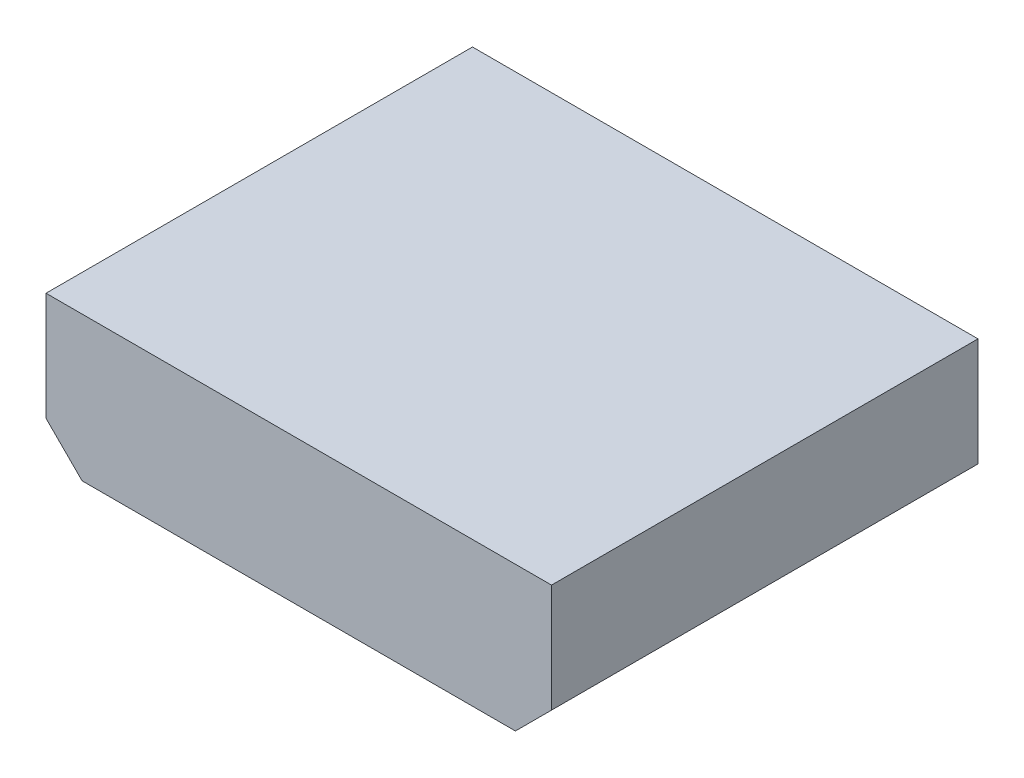
ISO-10303-21;
HEADER;
FILE_DESCRIPTION(('STEP AP214'),'2;1');
FILE_NAME('part.step','',(''),(''),'','','');
FILE_SCHEMA(('AUTOMOTIVE_DESIGN { 1 0 10303 214 1 1 1 1 }'));
ENDSEC;
DATA;
#1=APPLICATION_CONTEXT('core data for automotive mechanical design processes');
#2=APPLICATION_PROTOCOL_DEFINITION('international standard','automotive_design',2000,#1);
#3=PRODUCT_CONTEXT('',#1,'mechanical');
#4=PRODUCT('Part','Part','',(#3));
#5=PRODUCT_RELATED_PRODUCT_CATEGORY('part','',(#4));
#6=PRODUCT_DEFINITION_FORMATION('','',#4);
#7=PRODUCT_DEFINITION_CONTEXT('part definition',#1,'design');
#8=PRODUCT_DEFINITION('design','',#6,#7);
#9=PRODUCT_DEFINITION_SHAPE('','',#8);
#10=(LENGTH_UNIT() NAMED_UNIT(*) SI_UNIT(.MILLI.,.METRE.));
#11=(NAMED_UNIT(*) PLANE_ANGLE_UNIT() SI_UNIT($,.RADIAN.));
#12=(NAMED_UNIT(*) SI_UNIT($,.STERADIAN.) SOLID_ANGLE_UNIT());
#13=UNCERTAINTY_MEASURE_WITH_UNIT(LENGTH_MEASURE(1.E-05),#10,'distance_accuracy_value','');
#14=(GEOMETRIC_REPRESENTATION_CONTEXT(3) GLOBAL_UNCERTAINTY_ASSIGNED_CONTEXT((#13)) GLOBAL_UNIT_ASSIGNED_CONTEXT((#10,
#11,#12)) REPRESENTATION_CONTEXT('',''));
#15=CARTESIAN_POINT('',(0.,0.,0.));
#16=DIRECTION('',(0.,0.,1.));
#17=DIRECTION('',(1.,0.,0.));
#18=AXIS2_PLACEMENT_3D('',#15,#16,#17);
#19=CARTESIAN_POINT('',(7.62,0.,-2.));
#20=DIRECTION('',(0.,0.,1.));
#21=DIRECTION('',(1.,0.,0.));
#22=AXIS2_PLACEMENT_3D('',#19,#20,#21);
#23=CYLINDRICAL_SURFACE('',#22,0.25);
#24=CARTESIAN_POINT('',(7.62,0.,-2.));
#25=DIRECTION('',(0.,0.,1.));
#26=DIRECTION('',(1.,0.,0.));
#27=AXIS2_PLACEMENT_3D('',#24,#25,#26);
#28=CIRCLE('',#27,0.25);
#29=CARTESIAN_POINT('',(7.87,0.,-2.));
#30=VERTEX_POINT('',#29);
#31=EDGE_CURVE('E11',#30,#30,#28,.T.);
#32=ORIENTED_EDGE('',*,*,#31,.T.);
#33=EDGE_LOOP('',(#32));
#34=FACE_BOUND('',#33,.T.);
#35=CARTESIAN_POINT('',(7.62,0.,0.));
#36=DIRECTION('',(0.,0.,1.));
#37=DIRECTION('',(1.,0.,0.));
#38=AXIS2_PLACEMENT_3D('',#35,#36,#37);
#39=CIRCLE('',#38,0.25);
#40=CARTESIAN_POINT('',(7.87,0.,0.));
#41=VERTEX_POINT('',#40);
#42=EDGE_CURVE('E43',#41,#41,#39,.T.);
#43=ORIENTED_EDGE('',*,*,#42,.F.);
#44=EDGE_LOOP('',(#43));
#45=FACE_BOUND('',#44,.T.);
#46=ADVANCED_FACE('F40',(#34,#45),#23,.T.);
#47=CARTESIAN_POINT('',(7.62,0.,-2.));
#48=DIRECTION('',(0.,0.,1.));
#49=DIRECTION('',(1.,0.,0.));
#50=AXIS2_PLACEMENT_3D('',#47,#48,#49);
#51=PLANE('',#50);
#52=ORIENTED_EDGE('',*,*,#31,.F.);
#53=EDGE_LOOP('',(#52));
#54=FACE_BOUND('',#53,.T.);
#55=ADVANCED_FACE('F55',(#54),#51,.F.);
#56=CARTESIAN_POINT('',(7.62,0.,0.));
#57=DIRECTION('',(0.,0.,1.));
#58=DIRECTION('',(1.,0.,0.));
#59=AXIS2_PLACEMENT_3D('',#56,#57,#58);
#60=PLANE('',#59);
#61=ORIENTED_EDGE('',*,*,#42,.T.);
#62=EDGE_LOOP('',(#61));
#63=FACE_BOUND('',#62,.T.);
#64=ADVANCED_FACE('F52',(#63),#60,.T.);
#65=CLOSED_SHELL('',(#46,#55,#64));
#66=MANIFOLD_SOLID_BREP('B2',#65);
#67=CARTESIAN_POINT('',(5.08,0.,-2.));
#68=DIRECTION('',(0.,0.,1.));
#69=DIRECTION('',(1.,0.,0.));
#70=AXIS2_PLACEMENT_3D('',#67,#68,#69);
#71=CYLINDRICAL_SURFACE('',#70,0.25);
#72=CARTESIAN_POINT('',(5.08,0.,-2.));
#73=DIRECTION('',(0.,0.,1.));
#74=DIRECTION('',(1.,0.,0.));
#75=AXIS2_PLACEMENT_3D('',#72,#73,#74);
#76=CIRCLE('',#75,0.25);
#77=CARTESIAN_POINT('',(5.33,0.,-2.));
#78=VERTEX_POINT('',#77);
#79=EDGE_CURVE('E39',#78,#78,#76,.T.);
#80=ORIENTED_EDGE('',*,*,#79,.T.);
#81=EDGE_LOOP('',(#80));
#82=FACE_BOUND('',#81,.T.);
#83=CARTESIAN_POINT('',(5.08,0.,0.));
#84=DIRECTION('',(0.,0.,1.));
#85=DIRECTION('',(1.,0.,0.));
#86=AXIS2_PLACEMENT_3D('',#83,#84,#85);
#87=CIRCLE('',#86,0.25);
#88=CARTESIAN_POINT('',(5.33,0.,0.));
#89=VERTEX_POINT('',#88);
#90=EDGE_CURVE('E92',#89,#89,#87,.T.);
#91=ORIENTED_EDGE('',*,*,#90,.F.);
#92=EDGE_LOOP('',(#91));
#93=FACE_BOUND('',#92,.T.);
#94=ADVANCED_FACE('F89',(#82,#93),#71,.T.);
#95=CARTESIAN_POINT('',(5.08,0.,-2.));
#96=DIRECTION('',(0.,0.,1.));
#97=DIRECTION('',(1.,0.,0.));
#98=AXIS2_PLACEMENT_3D('',#95,#96,#97);
#99=PLANE('',#98);
#100=ORIENTED_EDGE('',*,*,#79,.F.);
#101=EDGE_LOOP('',(#100));
#102=FACE_BOUND('',#101,.T.);
#103=ADVANCED_FACE('F104',(#102),#99,.F.);
#104=CARTESIAN_POINT('',(5.08,0.,0.));
#105=DIRECTION('',(0.,0.,1.));
#106=DIRECTION('',(1.,0.,0.));
#107=AXIS2_PLACEMENT_3D('',#104,#105,#106);
#108=PLANE('',#107);
#109=ORIENTED_EDGE('',*,*,#90,.T.);
#110=EDGE_LOOP('',(#109));
#111=FACE_BOUND('',#110,.T.);
#112=ADVANCED_FACE('F101',(#111),#108,.T.);
#113=CLOSED_SHELL('',(#94,#103,#112));
#114=MANIFOLD_SOLID_BREP('B6',#113);
#115=CARTESIAN_POINT('',(2.54,0.,-2.));
#116=DIRECTION('',(0.,0.,1.));
#117=DIRECTION('',(1.,0.,0.));
#118=AXIS2_PLACEMENT_3D('',#115,#116,#117);
#119=CYLINDRICAL_SURFACE('',#118,0.25);
#120=CARTESIAN_POINT('',(2.54,0.,-2.));
#121=DIRECTION('',(0.,0.,1.));
#122=DIRECTION('',(1.,0.,0.));
#123=AXIS2_PLACEMENT_3D('',#120,#121,#122);
#124=CIRCLE('',#123,0.25);
#125=CARTESIAN_POINT('',(2.79,0.,-2.));
#126=VERTEX_POINT('',#125);
#127=EDGE_CURVE('E88',#126,#126,#124,.T.);
#128=ORIENTED_EDGE('',*,*,#127,.T.);
#129=EDGE_LOOP('',(#128));
#130=FACE_BOUND('',#129,.T.);
#131=CARTESIAN_POINT('',(2.54,0.,0.));
#132=DIRECTION('',(0.,0.,1.));
#133=DIRECTION('',(1.,0.,0.));
#134=AXIS2_PLACEMENT_3D('',#131,#132,#133);
#135=CIRCLE('',#134,0.25);
#136=CARTESIAN_POINT('',(2.79,0.,0.));
#137=VERTEX_POINT('',#136);
#138=EDGE_CURVE('E141',#137,#137,#135,.T.);
#139=ORIENTED_EDGE('',*,*,#138,.F.);
#140=EDGE_LOOP('',(#139));
#141=FACE_BOUND('',#140,.T.);
#142=ADVANCED_FACE('F138',(#130,#141),#119,.T.);
#143=CARTESIAN_POINT('',(2.54,0.,-2.));
#144=DIRECTION('',(0.,0.,1.));
#145=DIRECTION('',(1.,0.,0.));
#146=AXIS2_PLACEMENT_3D('',#143,#144,#145);
#147=PLANE('',#146);
#148=ORIENTED_EDGE('',*,*,#127,.F.);
#149=EDGE_LOOP('',(#148));
#150=FACE_BOUND('',#149,.T.);
#151=ADVANCED_FACE('F153',(#150),#147,.F.);
#152=CARTESIAN_POINT('',(2.54,0.,0.));
#153=DIRECTION('',(0.,0.,1.));
#154=DIRECTION('',(1.,0.,0.));
#155=AXIS2_PLACEMENT_3D('',#152,#153,#154);
#156=PLANE('',#155);
#157=ORIENTED_EDGE('',*,*,#138,.T.);
#158=EDGE_LOOP('',(#157));
#159=FACE_BOUND('',#158,.T.);
#160=ADVANCED_FACE('F150',(#159),#156,.T.);
#161=CLOSED_SHELL('',(#142,#151,#160));
#162=MANIFOLD_SOLID_BREP('B34',#161);
#163=CARTESIAN_POINT('',(0.,0.,-2.));
#164=DIRECTION('',(0.,0.,1.));
#165=DIRECTION('',(1.,0.,0.));
#166=AXIS2_PLACEMENT_3D('',#163,#164,#165);
#167=CYLINDRICAL_SURFACE('',#166,0.25);
#168=CARTESIAN_POINT('',(0.,0.,-2.));
#169=DIRECTION('',(0.,0.,1.));
#170=DIRECTION('',(1.,0.,0.));
#171=AXIS2_PLACEMENT_3D('',#168,#169,#170);
#172=CIRCLE('',#171,0.25);
#173=CARTESIAN_POINT('',(0.25,0.,-2.));
#174=VERTEX_POINT('',#173);
#175=EDGE_CURVE('E137',#174,#174,#172,.T.);
#176=ORIENTED_EDGE('',*,*,#175,.T.);
#177=EDGE_LOOP('',(#176));
#178=FACE_BOUND('',#177,.T.);
#179=CARTESIAN_POINT('',(0.,0.,0.));
#180=DIRECTION('',(0.,0.,1.));
#181=DIRECTION('',(1.,0.,0.));
#182=AXIS2_PLACEMENT_3D('',#179,#180,#181);
#183=CIRCLE('',#182,0.25);
#184=CARTESIAN_POINT('',(0.25,0.,0.));
#185=VERTEX_POINT('',#184);
#186=EDGE_CURVE('E191',#185,#185,#183,.T.);
#187=ORIENTED_EDGE('',*,*,#186,.F.);
#188=EDGE_LOOP('',(#187));
#189=FACE_BOUND('',#188,.T.);
#190=ADVANCED_FACE('F188',(#178,#189),#167,.T.);
#191=CARTESIAN_POINT('',(0.,0.,-2.));
#192=DIRECTION('',(0.,0.,1.));
#193=DIRECTION('',(1.,0.,0.));
#194=AXIS2_PLACEMENT_3D('',#191,#192,#193);
#195=PLANE('',#194);
#196=ORIENTED_EDGE('',*,*,#175,.F.);
#197=EDGE_LOOP('',(#196));
#198=FACE_BOUND('',#197,.T.);
#199=ADVANCED_FACE('F203',(#198),#195,.F.);
#200=CARTESIAN_POINT('',(0.,0.,0.));
#201=DIRECTION('',(0.,0.,1.));
#202=DIRECTION('',(1.,0.,0.));
#203=AXIS2_PLACEMENT_3D('',#200,#201,#202);
#204=PLANE('',#203);
#205=ORIENTED_EDGE('',*,*,#186,.T.);
#206=EDGE_LOOP('',(#205));
#207=FACE_BOUND('',#206,.T.);
#208=ADVANCED_FACE('F200',(#207),#204,.T.);
#209=CLOSED_SHELL('',(#190,#199,#208));
#210=MANIFOLD_SOLID_BREP('B83',#209);
#211=CARTESIAN_POINT('',(12.7,2.54,15.));
#212=DIRECTION('',(0.,-1.,0.));
#213=DIRECTION('',(0.,0.,-1.));
#214=AXIS2_PLACEMENT_3D('',#211,#212,#213);
#215=PLANE('',#214);
#216=DIRECTION('',(-1.,0.,0.));
#217=VECTOR('',#216,1.);
#218=CARTESIAN_POINT('',(12.7,2.54,0.));
#219=LINE('',#218,#217);
#220=CARTESIAN_POINT('',(12.7,2.54,0.));
#221=VERTEX_POINT('',#220);
#222=CARTESIAN_POINT('',(-5.08,2.54,0.));
#223=VERTEX_POINT('',#222);
#224=EDGE_CURVE('E313',#221,#223,#219,.T.);
#225=ORIENTED_EDGE('',*,*,#224,.T.);
#226=DIRECTION('',(0.,0.,-1.));
#227=VECTOR('',#226,1.);
#228=CARTESIAN_POINT('',(-5.08,2.54,15.));
#229=LINE('',#228,#227);
#230=CARTESIAN_POINT('',(-5.08,2.54,15.));
#231=VERTEX_POINT('',#230);
#232=EDGE_CURVE('E186',#231,#223,#229,.T.);
#233=ORIENTED_EDGE('',*,*,#232,.F.);
#234=DIRECTION('',(-1.,0.,0.));
#235=VECTOR('',#234,1.);
#236=CARTESIAN_POINT('',(12.7,2.54,15.));
#237=LINE('',#236,#235);
#238=CARTESIAN_POINT('',(12.7,2.54,15.));
#239=VERTEX_POINT('',#238);
#240=EDGE_CURVE('E323',#239,#231,#237,.T.);
#241=ORIENTED_EDGE('',*,*,#240,.F.);
#242=DIRECTION('',(0.,0.,-1.));
#243=VECTOR('',#242,1.);
#244=CARTESIAN_POINT('',(12.7,2.54,15.));
#245=LINE('',#244,#243);
#246=EDGE_CURVE('E309',#239,#221,#245,.T.);
#247=ORIENTED_EDGE('',*,*,#246,.T.);
#248=EDGE_LOOP('',(#225,#233,#241,#247));
#249=FACE_BOUND('',#248,.T.);
#250=ADVANCED_FACE('F229',(#249),#215,.F.);
#251=CARTESIAN_POINT('',(-5.08,2.54,15.));
#252=DIRECTION('',(1.,0.,0.));
#253=DIRECTION('',(0.,0.,-1.));
#254=AXIS2_PLACEMENT_3D('',#251,#252,#253);
#255=PLANE('',#254);
#256=DIRECTION('',(0.,-1.,0.));
#257=VECTOR('',#256,1.);
#258=CARTESIAN_POINT('',(-5.08,2.54,0.));
#259=LINE('',#258,#257);
#260=CARTESIAN_POINT('',(-5.08,-1.27,0.));
#261=VERTEX_POINT('',#260);
#262=EDGE_CURVE('E316',#223,#261,#259,.T.);
#263=ORIENTED_EDGE('',*,*,#262,.T.);
#264=DIRECTION('',(0.,0.,-1.));
#265=VECTOR('',#264,1.);
#266=CARTESIAN_POINT('',(-5.08,-1.27,15.));
#267=LINE('',#266,#265);
#268=CARTESIAN_POINT('',(-5.08,-1.27,15.));
#269=VERTEX_POINT('',#268);
#270=EDGE_CURVE('E237',#269,#261,#267,.T.);
#271=ORIENTED_EDGE('',*,*,#270,.F.);
#272=DIRECTION('',(0.,-1.,0.));
#273=VECTOR('',#272,1.);
#274=CARTESIAN_POINT('',(-5.08,2.54,15.));
#275=LINE('',#274,#273);
#276=EDGE_CURVE('E282',#231,#269,#275,.T.);
#277=ORIENTED_EDGE('',*,*,#276,.F.);
#278=ORIENTED_EDGE('',*,*,#232,.T.);
#279=EDGE_LOOP('',(#263,#271,#277,#278));
#280=FACE_BOUND('',#279,.T.);
#281=ADVANCED_FACE('F347',(#280),#255,.F.);
#282=CARTESIAN_POINT('',(-5.08,-1.27,15.));
#283=DIRECTION('',(0.707106781186547,0.707106781186548,0.));
#284=DIRECTION('',(-0.707106781186548,0.707106781186547,0.));
#285=AXIS2_PLACEMENT_3D('',#282,#283,#284);
#286=PLANE('',#285);
#287=DIRECTION('',(0.707106781186548,-0.707106781186547,0.));
#288=VECTOR('',#287,1.);
#289=CARTESIAN_POINT('',(-5.08,-1.27,0.));
#290=LINE('',#289,#288);
#291=CARTESIAN_POINT('',(-3.81,-2.54,0.));
#292=VERTEX_POINT('',#291);
#293=EDGE_CURVE('E318',#261,#292,#290,.T.);
#294=ORIENTED_EDGE('',*,*,#293,.T.);
#295=DIRECTION('',(0.,0.,-1.));
#296=VECTOR('',#295,1.);
#297=CARTESIAN_POINT('',(-3.81,-2.54,15.));
#298=LINE('',#297,#296);
#299=CARTESIAN_POINT('',(-3.81,-2.54,15.));
#300=VERTEX_POINT('',#299);
#301=EDGE_CURVE('E304',#300,#292,#298,.T.);
#302=ORIENTED_EDGE('',*,*,#301,.F.);
#303=DIRECTION('',(0.707106781186548,-0.707106781186547,0.));
#304=VECTOR('',#303,1.);
#305=CARTESIAN_POINT('',(-5.08,-1.27,15.));
#306=LINE('',#305,#304);
#307=EDGE_CURVE('E295',#269,#300,#306,.T.);
#308=ORIENTED_EDGE('',*,*,#307,.F.);
#309=ORIENTED_EDGE('',*,*,#270,.T.);
#310=EDGE_LOOP('',(#294,#302,#308,#309));
#311=FACE_BOUND('',#310,.T.);
#312=ADVANCED_FACE('F329',(#311),#286,.F.);
#313=CARTESIAN_POINT('',(-3.81,-2.54,15.));
#314=DIRECTION('',(0.,1.,0.));
#315=DIRECTION('',(0.,0.,1.));
#316=AXIS2_PLACEMENT_3D('',#313,#314,#315);
#317=PLANE('',#316);
#318=DIRECTION('',(1.,0.,0.));
#319=VECTOR('',#318,1.);
#320=CARTESIAN_POINT('',(-3.81,-2.54,0.));
#321=LINE('',#320,#319);
#322=CARTESIAN_POINT('',(11.43,-2.54,0.));
#323=VERTEX_POINT('',#322);
#324=EDGE_CURVE('E303',#292,#323,#321,.T.);
#325=ORIENTED_EDGE('',*,*,#324,.T.);
#326=DIRECTION('',(0.,0.,-1.));
#327=VECTOR('',#326,1.);
#328=CARTESIAN_POINT('',(11.43,-2.54,15.));
#329=LINE('',#328,#327);
#330=CARTESIAN_POINT('',(11.43,-2.54,15.));
#331=VERTEX_POINT('',#330);
#332=EDGE_CURVE('E300',#331,#323,#329,.T.);
#333=ORIENTED_EDGE('',*,*,#332,.F.);
#334=DIRECTION('',(1.,0.,0.));
#335=VECTOR('',#334,1.);
#336=CARTESIAN_POINT('',(-3.81,-2.54,15.));
#337=LINE('',#336,#335);
#338=EDGE_CURVE('E289',#300,#331,#337,.T.);
#339=ORIENTED_EDGE('',*,*,#338,.F.);
#340=ORIENTED_EDGE('',*,*,#301,.T.);
#341=EDGE_LOOP('',(#325,#333,#339,#340));
#342=FACE_BOUND('',#341,.T.);
#343=ADVANCED_FACE('F301',(#342),#317,.F.);
#344=CARTESIAN_POINT('',(11.43,-2.54,15.));
#345=DIRECTION('',(-0.707106781186547,0.707106781186548,0.));
#346=DIRECTION('',(-0.707106781186548,-0.707106781186547,0.));
#347=AXIS2_PLACEMENT_3D('',#344,#345,#346);
#348=PLANE('',#347);
#349=DIRECTION('',(0.707106781186548,0.707106781186547,0.));
#350=VECTOR('',#349,1.);
#351=CARTESIAN_POINT('',(11.43,-2.54,0.));
#352=LINE('',#351,#350);
#353=CARTESIAN_POINT('',(12.7,-1.27,0.));
#354=VERTEX_POINT('',#353);
#355=EDGE_CURVE('E268',#323,#354,#352,.T.);
#356=ORIENTED_EDGE('',*,*,#355,.T.);
#357=DIRECTION('',(0.,0.,-1.));
#358=VECTOR('',#357,1.);
#359=CARTESIAN_POINT('',(12.7,-1.27,15.));
#360=LINE('',#359,#358);
#361=CARTESIAN_POINT('',(12.7,-1.27,15.));
#362=VERTEX_POINT('',#361);
#363=EDGE_CURVE('E305',#362,#354,#360,.T.);
#364=ORIENTED_EDGE('',*,*,#363,.F.);
#365=DIRECTION('',(0.707106781186548,0.707106781186547,0.));
#366=VECTOR('',#365,1.);
#367=CARTESIAN_POINT('',(11.43,-2.54,15.));
#368=LINE('',#367,#366);
#369=EDGE_CURVE('E293',#331,#362,#368,.T.);
#370=ORIENTED_EDGE('',*,*,#369,.F.);
#371=ORIENTED_EDGE('',*,*,#332,.T.);
#372=EDGE_LOOP('',(#356,#364,#370,#371));
#373=FACE_BOUND('',#372,.T.);
#374=ADVANCED_FACE('F307',(#373),#348,.F.);
#375=CARTESIAN_POINT('',(12.7,-1.27,15.));
#376=DIRECTION('',(-1.,0.,0.));
#377=DIRECTION('',(0.,0.,1.));
#378=AXIS2_PLACEMENT_3D('',#375,#376,#377);
#379=PLANE('',#378);
#380=DIRECTION('',(0.,1.,0.));
#381=VECTOR('',#380,1.);
#382=CARTESIAN_POINT('',(12.7,-1.27,0.));
#383=LINE('',#382,#381);
#384=EDGE_CURVE('E274',#354,#221,#383,.T.);
#385=ORIENTED_EDGE('',*,*,#384,.T.);
#386=ORIENTED_EDGE('',*,*,#246,.F.);
#387=DIRECTION('',(0.,1.,0.));
#388=VECTOR('',#387,1.);
#389=CARTESIAN_POINT('',(12.7,-1.27,15.));
#390=LINE('',#389,#388);
#391=EDGE_CURVE('E245',#362,#239,#390,.T.);
#392=ORIENTED_EDGE('',*,*,#391,.F.);
#393=ORIENTED_EDGE('',*,*,#363,.T.);
#394=EDGE_LOOP('',(#385,#386,#392,#393));
#395=FACE_BOUND('',#394,.T.);
#396=ADVANCED_FACE('F336',(#395),#379,.F.);
#397=CARTESIAN_POINT('',(0.,0.,15.));
#398=DIRECTION('',(0.,0.,1.));
#399=DIRECTION('',(1.,0.,0.));
#400=AXIS2_PLACEMENT_3D('',#397,#398,#399);
#401=PLANE('',#400);
#402=ORIENTED_EDGE('',*,*,#240,.T.);
#403=ORIENTED_EDGE('',*,*,#276,.T.);
#404=ORIENTED_EDGE('',*,*,#307,.T.);
#405=ORIENTED_EDGE('',*,*,#338,.T.);
#406=ORIENTED_EDGE('',*,*,#369,.T.);
#407=ORIENTED_EDGE('',*,*,#391,.T.);
#408=EDGE_LOOP('',(#402,#403,#404,#405,#406,#407));
#409=FACE_BOUND('',#408,.T.);
#410=ADVANCED_FACE('F291',(#409),#401,.T.);
#411=CARTESIAN_POINT('',(0.,0.,0.));
#412=DIRECTION('',(0.,0.,1.));
#413=DIRECTION('',(1.,0.,0.));
#414=AXIS2_PLACEMENT_3D('',#411,#412,#413);
#415=PLANE('',#414);
#416=ORIENTED_EDGE('',*,*,#224,.F.);
#417=ORIENTED_EDGE('',*,*,#384,.F.);
#418=ORIENTED_EDGE('',*,*,#355,.F.);
#419=ORIENTED_EDGE('',*,*,#324,.F.);
#420=ORIENTED_EDGE('',*,*,#293,.F.);
#421=ORIENTED_EDGE('',*,*,#262,.F.);
#422=EDGE_LOOP('',(#416,#417,#418,#419,#420,#421));
#423=FACE_BOUND('',#422,.T.);
#424=ADVANCED_FACE('F332',(#423),#415,.F.);
#425=CLOSED_SHELL('',(#250,#281,#312,#343,#374,#396,#410,#424));
#426=MANIFOLD_SOLID_BREP('B132',#425);
#427=ADVANCED_BREP_SHAPE_REPRESENTATION('',(#18,#66,#114,#162,#210,#426),#14);
#428=SHAPE_DEFINITION_REPRESENTATION(#9,#427);
ENDSEC;
END-ISO-10303-21;
